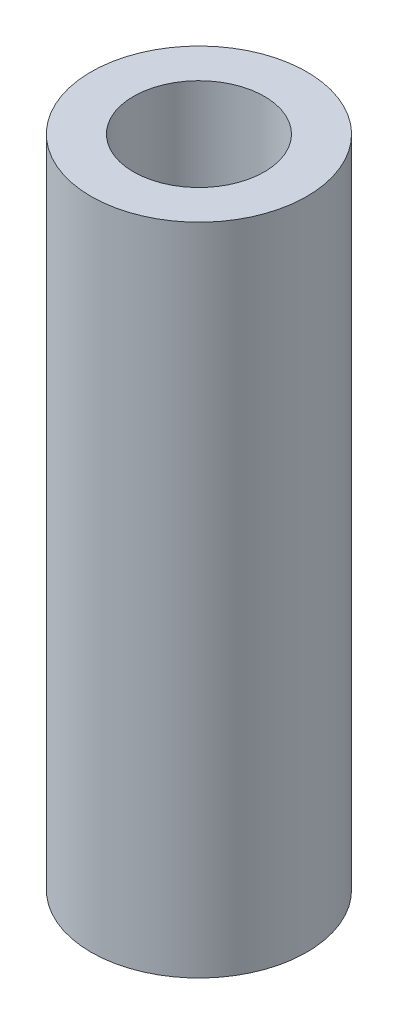
ISO-10303-21;
HEADER;
FILE_DESCRIPTION(('STEP AP214'),'2;1');
FILE_NAME('part.step','',(''),(''),'','','');
FILE_SCHEMA(('AUTOMOTIVE_DESIGN { 1 0 10303 214 1 1 1 1 }'));
ENDSEC;
DATA;
#1=APPLICATION_CONTEXT('core data for automotive mechanical design processes');
#2=APPLICATION_PROTOCOL_DEFINITION('international standard','automotive_design',2000,#1);
#3=PRODUCT_CONTEXT('',#1,'mechanical');
#4=PRODUCT('Part','Part','',(#3));
#5=PRODUCT_RELATED_PRODUCT_CATEGORY('part','',(#4));
#6=PRODUCT_DEFINITION_FORMATION('','',#4);
#7=PRODUCT_DEFINITION_CONTEXT('part definition',#1,'design');
#8=PRODUCT_DEFINITION('design','',#6,#7);
#9=PRODUCT_DEFINITION_SHAPE('','',#8);
#10=(LENGTH_UNIT() NAMED_UNIT(*) SI_UNIT(.MILLI.,.METRE.));
#11=(NAMED_UNIT(*) PLANE_ANGLE_UNIT() SI_UNIT($,.RADIAN.));
#12=(NAMED_UNIT(*) SI_UNIT($,.STERADIAN.) SOLID_ANGLE_UNIT());
#13=UNCERTAINTY_MEASURE_WITH_UNIT(LENGTH_MEASURE(1.E-05),#10,'distance_accuracy_value','');
#14=(GEOMETRIC_REPRESENTATION_CONTEXT(3) GLOBAL_UNCERTAINTY_ASSIGNED_CONTEXT((#13)) GLOBAL_UNIT_ASSIGNED_CONTEXT((#10,
#11,#12)) REPRESENTATION_CONTEXT('',''));
#15=CARTESIAN_POINT('',(0.,0.,0.));
#16=DIRECTION('',(0.,0.,1.));
#17=DIRECTION('',(1.,0.,0.));
#18=AXIS2_PLACEMENT_3D('',#15,#16,#17);
#19=CARTESIAN_POINT('',(0.,304.8,0.));
#20=DIRECTION('',(0.,1.,0.));
#21=DIRECTION('',(0.,0.,1.));
#22=AXIS2_PLACEMENT_3D('',#19,#20,#21);
#23=PLANE('',#22);
#24=CARTESIAN_POINT('',(0.,304.8,0.));
#25=DIRECTION('',(0.,1.,0.));
#26=DIRECTION('',(0.,0.,1.));
#27=AXIS2_PLACEMENT_3D('',#24,#25,#26);
#28=CIRCLE('',#27,50.2539);
#29=CARTESIAN_POINT('',(0.,304.8,50.2539));
#30=VERTEX_POINT('',#29);
#31=EDGE_CURVE('E10',#30,#30,#28,.T.);
#32=ORIENTED_EDGE('',*,*,#31,.T.);
#33=EDGE_LOOP('',(#32));
#34=FACE_BOUND('',#33,.T.);
#35=CARTESIAN_POINT('',(0.,304.8,0.));
#36=DIRECTION('',(0.,1.,0.));
#37=DIRECTION('',(0.,0.,1.));
#38=AXIS2_PLACEMENT_3D('',#35,#36,#37);
#39=CIRCLE('',#38,30.48);
#40=CARTESIAN_POINT('',(0.,304.8,30.48));
#41=VERTEX_POINT('',#40);
#42=EDGE_CURVE('E54',#41,#41,#39,.T.);
#43=ORIENTED_EDGE('',*,*,#42,.F.);
#44=EDGE_LOOP('',(#43));
#45=FACE_BOUND('',#44,.T.);
#46=ADVANCED_FACE('F41',(#34,#45),#23,.T.);
#47=CARTESIAN_POINT('',(0.,0.,0.));
#48=DIRECTION('',(0.,1.,0.));
#49=DIRECTION('',(0.,0.,1.));
#50=AXIS2_PLACEMENT_3D('',#47,#48,#49);
#51=PLANE('',#50);
#52=CARTESIAN_POINT('',(0.,0.,0.));
#53=DIRECTION('',(0.,1.,0.));
#54=DIRECTION('',(0.,0.,1.));
#55=AXIS2_PLACEMENT_3D('',#52,#53,#54);
#56=CIRCLE('',#55,50.2539);
#57=CARTESIAN_POINT('',(0.,0.,50.2539));
#58=VERTEX_POINT('',#57);
#59=EDGE_CURVE('E45',#58,#58,#56,.T.);
#60=ORIENTED_EDGE('',*,*,#59,.F.);
#61=EDGE_LOOP('',(#60));
#62=FACE_BOUND('',#61,.T.);
#63=CARTESIAN_POINT('',(0.,0.,0.));
#64=DIRECTION('',(0.,1.,0.));
#65=DIRECTION('',(0.,0.,1.));
#66=AXIS2_PLACEMENT_3D('',#63,#64,#65);
#67=CIRCLE('',#66,30.48);
#68=CARTESIAN_POINT('',(0.,0.,30.48));
#69=VERTEX_POINT('',#68);
#70=EDGE_CURVE('E56',#69,#69,#67,.T.);
#71=ORIENTED_EDGE('',*,*,#70,.T.);
#72=EDGE_LOOP('',(#71));
#73=FACE_BOUND('',#72,.T.);
#74=ADVANCED_FACE('F68',(#62,#73),#51,.F.);
#75=CARTESIAN_POINT('',(0.,304.8,0.));
#76=DIRECTION('',(0.,-1.,0.));
#77=DIRECTION('',(0.,0.,-1.));
#78=AXIS2_PLACEMENT_3D('',#75,#76,#77);
#79=CYLINDRICAL_SURFACE('',#78,50.2539);
#80=ORIENTED_EDGE('',*,*,#31,.F.);
#81=EDGE_LOOP('',(#80));
#82=FACE_BOUND('',#81,.T.);
#83=ORIENTED_EDGE('',*,*,#59,.T.);
#84=EDGE_LOOP('',(#83));
#85=FACE_BOUND('',#84,.T.);
#86=ADVANCED_FACE('F43',(#82,#85),#79,.T.);
#87=CARTESIAN_POINT('',(0.,304.8,0.));
#88=DIRECTION('',(0.,-1.,0.));
#89=DIRECTION('',(0.,0.,-1.));
#90=AXIS2_PLACEMENT_3D('',#87,#88,#89);
#91=CYLINDRICAL_SURFACE('',#90,30.48);
#92=ORIENTED_EDGE('',*,*,#42,.T.);
#93=EDGE_LOOP('',(#92));
#94=FACE_BOUND('',#93,.T.);
#95=ORIENTED_EDGE('',*,*,#70,.F.);
#96=EDGE_LOOP('',(#95));
#97=FACE_BOUND('',#96,.T.);
#98=ADVANCED_FACE('F64',(#94,#97),#91,.F.);
#99=CLOSED_SHELL('',(#46,#74,#86,#98));
#100=MANIFOLD_SOLID_BREP('B2',#99);
#101=ADVANCED_BREP_SHAPE_REPRESENTATION('',(#18,#100),#14);
#102=SHAPE_DEFINITION_REPRESENTATION(#9,#101);
ENDSEC;
END-ISO-10303-21;
